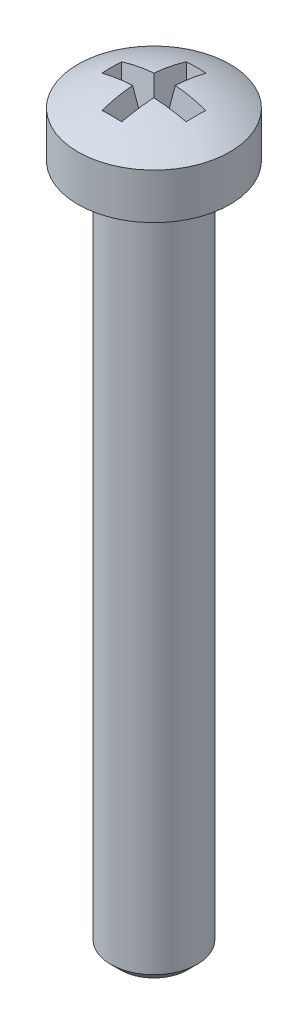
ISO-10303-21;
HEADER;
FILE_DESCRIPTION(('STEP AP214'),'2;1');
FILE_NAME('part.step','',(''),(''),'','','');
FILE_SCHEMA(('AUTOMOTIVE_DESIGN { 1 0 10303 214 1 1 1 1 }'));
ENDSEC;
DATA;
#1=APPLICATION_CONTEXT('core data for automotive mechanical design processes');
#2=APPLICATION_PROTOCOL_DEFINITION('international standard','automotive_design',2000,#1);
#3=PRODUCT_CONTEXT('',#1,'mechanical');
#4=PRODUCT('Part','Part','',(#3));
#5=PRODUCT_RELATED_PRODUCT_CATEGORY('part','',(#4));
#6=PRODUCT_DEFINITION_FORMATION('','',#4);
#7=PRODUCT_DEFINITION_CONTEXT('part definition',#1,'design');
#8=PRODUCT_DEFINITION('design','',#6,#7);
#9=PRODUCT_DEFINITION_SHAPE('','',#8);
#10=(LENGTH_UNIT() NAMED_UNIT(*) SI_UNIT(.MILLI.,.METRE.));
#11=(NAMED_UNIT(*) PLANE_ANGLE_UNIT() SI_UNIT($,.RADIAN.));
#12=(NAMED_UNIT(*) SI_UNIT($,.STERADIAN.) SOLID_ANGLE_UNIT());
#13=UNCERTAINTY_MEASURE_WITH_UNIT(LENGTH_MEASURE(1.E-05),#10,'distance_accuracy_value','');
#14=(GEOMETRIC_REPRESENTATION_CONTEXT(3) GLOBAL_UNCERTAINTY_ASSIGNED_CONTEXT((#13)) GLOBAL_UNIT_ASSIGNED_CONTEXT((#10,
#11,#12)) REPRESENTATION_CONTEXT('',''));
#15=CARTESIAN_POINT('',(0.,0.,0.));
#16=DIRECTION('',(0.,0.,1.));
#17=DIRECTION('',(1.,0.,0.));
#18=AXIS2_PLACEMENT_3D('',#15,#16,#17);
#19=CARTESIAN_POINT('',(5.7875,12.8,4.15199999999999));
#20=DIRECTION('',(0.,-0.149438132473599,0.988771077936042));
#21=DIRECTION('',(-1.,0.,0.));
#22=AXIS2_PLACEMENT_3D('',#19,#20,#21);
#23=PLANE('',#22);
#24=CARTESIAN_POINT('',(6.00000000000001,9.74139917848052,3.68973769788639));
#25=DIRECTION('',(0.,-0.149438132473599,0.988771077936042));
#26=DIRECTION('',(0.,0.988771077936042,0.149438132473599));
#27=AXIS2_PLACEMENT_3D('',#24,#25,#26);
#28=CIRCLE('',#27,2.97426048310416);
#29=CARTESIAN_POINT('',(6.19376146307785,12.6760147557736,4.13326146307783));
#30=VERTEX_POINT('',#29);
#31=CARTESIAN_POINT('',(5.80623853692216,12.6760147557736,4.13326146307783));
#32=VERTEX_POINT('',#31);
#33=EDGE_CURVE('E34',#30,#32,#28,.T.);
#34=ORIENTED_EDGE('',*,*,#33,.F.);
#35=DIRECTION('',(-0.14779696163853,-0.977912120929502,-0.14779696163853));
#36=VECTOR('',#35,1.);
#37=CARTESIAN_POINT('',(6.20785816235272,12.7692868564527,4.1473581623527));
#38=LINE('',#37,#36);
#39=CARTESIAN_POINT('',(6.01602421652422,11.5,3.9555242165242));
#40=VERTEX_POINT('',#39);
#41=EDGE_CURVE('E11',#30,#40,#38,.T.);
#42=ORIENTED_EDGE('',*,*,#41,.T.);
#43=DIRECTION('',(1.,0.,0.));
#44=VECTOR('',#43,1.);
#45=CARTESIAN_POINT('',(6.2125,11.5,3.9555242165242));
#46=LINE('',#45,#44);
#47=CARTESIAN_POINT('',(5.98397578347579,11.5,3.9555242165242));
#48=VERTEX_POINT('',#47);
#49=EDGE_CURVE('E20',#48,#40,#46,.T.);
#50=ORIENTED_EDGE('',*,*,#49,.F.);
#51=DIRECTION('',(0.14779696163853,-0.977912120929502,-0.14779696163853));
#52=VECTOR('',#51,1.);
#53=CARTESIAN_POINT('',(5.79446275647093,12.753930284679,4.14503724352908));
#54=LINE('',#53,#52);
#55=EDGE_CURVE('E26',#32,#48,#54,.T.);
#56=ORIENTED_EDGE('',*,*,#55,.F.);
#57=EDGE_LOOP('',(#34,#42,#50,#56));
#58=FACE_BOUND('',#57,.T.);
#59=ADVANCED_FACE('F16',(#58),#23,.F.);
#60=CARTESIAN_POINT('',(5.7875,12.8,3.5145));
#61=DIRECTION('',(-0.988771077936042,-0.149438132473599,0.));
#62=DIRECTION('',(0.,0.,-1.));
#63=AXIS2_PLACEMENT_3D('',#60,#61,#62);
#64=PLANE('',#63);
#65=CARTESIAN_POINT('',(6.2355258080224,9.83559624435382,3.302));
#66=DIRECTION('',(-0.988771077936042,-0.149438132473599,0.));
#67=DIRECTION('',(-0.149438132473599,0.988771077936042,0.));
#68=AXIS2_PLACEMENT_3D('',#65,#66,#67);
#69=CIRCLE('',#68,2.99052846519529);
#70=CARTESIAN_POINT('',(5.78973284200671,12.7852261965451,3.5122671579933));
#71=VERTEX_POINT('',#70);
#72=EDGE_CURVE('E255',#32,#71,#69,.T.);
#73=ORIENTED_EDGE('',*,*,#72,.F.);
#74=ORIENTED_EDGE('',*,*,#55,.T.);
#75=DIRECTION('',(0.,0.,1.));
#76=VECTOR('',#75,1.);
#77=CARTESIAN_POINT('',(5.98397578347579,11.5,4.15199999999999));
#78=LINE('',#77,#76);
#79=CARTESIAN_POINT('',(5.98397578347579,11.5,3.31802421652422));
#80=VERTEX_POINT('',#79);
#81=EDGE_CURVE('E120',#80,#48,#78,.T.);
#82=ORIENTED_EDGE('',*,*,#81,.F.);
#83=DIRECTION('',(0.14779696163853,-0.977912120929502,-0.14779696163853));
#84=VECTOR('',#83,1.);
#85=CARTESIAN_POINT('',(5.78053724352907,12.846069715321,3.52146275647092));
#86=LINE('',#85,#84);
#87=EDGE_CURVE('E229',#71,#80,#86,.T.);
#88=ORIENTED_EDGE('',*,*,#87,.F.);
#89=EDGE_LOOP('',(#73,#74,#82,#88));
#90=FACE_BOUND('',#89,.T.);
#91=ADVANCED_FACE('F160',(#90),#64,.F.);
#92=CARTESIAN_POINT('',(5.15,12.8,3.5145));
#93=DIRECTION('',(0.,-0.149438132473599,0.988771077936042));
#94=DIRECTION('',(-1.,0.,0.));
#95=AXIS2_PLACEMENT_3D('',#92,#93,#94);
#96=PLANE('',#95);
#97=CARTESIAN_POINT('',(6.00000000000001,9.83559624435382,3.06647419197759));
#98=DIRECTION('',(0.,-0.149438132473599,0.988771077936042));
#99=DIRECTION('',(0.,0.988771077936042,0.149438132473599));
#100=AXIS2_PLACEMENT_3D('',#97,#98,#99);
#101=CIRCLE('',#100,2.99052846519529);
#102=CARTESIAN_POINT('',(5.16873853692217,12.6760147557736,3.49576146307784));
#103=VERTEX_POINT('',#102);
#104=EDGE_CURVE('E257',#71,#103,#101,.T.);
#105=ORIENTED_EDGE('',*,*,#104,.F.);
#106=ORIENTED_EDGE('',*,*,#87,.T.);
#107=DIRECTION('',(1.,0.,0.));
#108=VECTOR('',#107,1.);
#109=CARTESIAN_POINT('',(5.7875,11.5,3.31802421652422));
#110=LINE('',#109,#108);
#111=CARTESIAN_POINT('',(5.34647578347579,11.5,3.31802421652422));
#112=VERTEX_POINT('',#111);
#113=EDGE_CURVE('E117',#112,#80,#110,.T.);
#114=ORIENTED_EDGE('',*,*,#113,.F.);
#115=DIRECTION('',(0.14779696163853,-0.977912120929502,-0.14779696163853));
#116=VECTOR('',#115,1.);
#117=CARTESIAN_POINT('',(5.15464183764729,12.7692868564527,3.50985816235272));
#118=LINE('',#117,#116);
#119=EDGE_CURVE('E226',#103,#112,#118,.T.);
#120=ORIENTED_EDGE('',*,*,#119,.F.);
#121=EDGE_LOOP('',(#105,#106,#114,#120));
#122=FACE_BOUND('',#121,.T.);
#123=ADVANCED_FACE('F164',(#122),#96,.F.);
#124=CARTESIAN_POINT('',(5.15,12.8,3.08949999999999));
#125=DIRECTION('',(-0.988771077936042,-0.149438132473599,0.));
#126=DIRECTION('',(0.,0.,-1.));
#127=AXIS2_PLACEMENT_3D('',#124,#125,#126);
#128=PLANE('',#127);
#129=CARTESIAN_POINT('',(5.61226230211363,9.74139917848052,3.302));
#130=DIRECTION('',(-0.988771077936042,-0.149438132473599,0.));
#131=DIRECTION('',(-0.149438132473599,0.988771077936042,0.));
#132=AXIS2_PLACEMENT_3D('',#129,#130,#131);
#133=CIRCLE('',#132,2.97426048310416);
#134=CARTESIAN_POINT('',(5.16873853692217,12.6760147557736,3.10823853692216));
#135=VERTEX_POINT('',#134);
#136=EDGE_CURVE('E139',#103,#135,#133,.T.);
#137=ORIENTED_EDGE('',*,*,#136,.F.);
#138=ORIENTED_EDGE('',*,*,#119,.T.);
#139=DIRECTION('',(0.,0.,1.));
#140=VECTOR('',#139,1.);
#141=CARTESIAN_POINT('',(5.34647578347579,11.5,3.5145));
#142=LINE('',#141,#140);
#143=CARTESIAN_POINT('',(5.34647578347579,11.5,3.28597578347578));
#144=VERTEX_POINT('',#143);
#145=EDGE_CURVE('E119',#144,#112,#142,.T.);
#146=ORIENTED_EDGE('',*,*,#145,.F.);
#147=DIRECTION('',(0.14779696163853,-0.977912120929502,0.14779696163853));
#148=VECTOR('',#147,1.);
#149=CARTESIAN_POINT('',(5.15696275647093,12.753930284679,3.09646275647094));
#150=LINE('',#149,#148);
#151=EDGE_CURVE('E230',#135,#144,#150,.T.);
#152=ORIENTED_EDGE('',*,*,#151,.F.);
#153=EDGE_LOOP('',(#137,#138,#146,#152));
#154=FACE_BOUND('',#153,.T.);
#155=ADVANCED_FACE('F170',(#154),#128,.F.);
#156=CARTESIAN_POINT('',(5.7875,12.8,3.08949999999999));
#157=DIRECTION('',(0.,-0.149438132473599,-0.988771077936042));
#158=DIRECTION('',(1.,0.,0.));
#159=AXIS2_PLACEMENT_3D('',#156,#157,#158);
#160=PLANE('',#159);
#161=CARTESIAN_POINT('',(6.00000000000001,9.83559624435382,3.53752580802241));
#162=DIRECTION('',(0.,-0.149438132473599,-0.988771077936042));
#163=DIRECTION('',(0.,-0.988771077936042,0.149438132473599));
#164=AXIS2_PLACEMENT_3D('',#161,#162,#163);
#165=CIRCLE('',#164,2.99052846519529);
#166=CARTESIAN_POINT('',(5.78973284200671,12.7852261965451,3.09173284200673));
#167=VERTEX_POINT('',#166);
#168=EDGE_CURVE('E109',#135,#167,#165,.T.);
#169=ORIENTED_EDGE('',*,*,#168,.F.);
#170=ORIENTED_EDGE('',*,*,#151,.T.);
#171=DIRECTION('',(-1.,0.,0.));
#172=VECTOR('',#171,1.);
#173=CARTESIAN_POINT('',(5.15,11.5,3.28597578347578));
#174=LINE('',#173,#172);
#175=CARTESIAN_POINT('',(5.98397578347579,11.5,3.28597578347578));
#176=VERTEX_POINT('',#175);
#177=EDGE_CURVE('E262',#176,#144,#174,.T.);
#178=ORIENTED_EDGE('',*,*,#177,.F.);
#179=DIRECTION('',(0.14779696163853,-0.977912120929502,0.14779696163853));
#180=VECTOR('',#179,1.);
#181=CARTESIAN_POINT('',(5.78053724352907,12.846069715321,3.08253724352908));
#182=LINE('',#181,#180);
#183=EDGE_CURVE('E231',#167,#176,#182,.T.);
#184=ORIENTED_EDGE('',*,*,#183,.F.);
#185=EDGE_LOOP('',(#169,#170,#178,#184));
#186=FACE_BOUND('',#185,.T.);
#187=ADVANCED_FACE('F182',(#186),#160,.F.);
#188=CARTESIAN_POINT('',(5.7875,12.8,2.45200000000001));
#189=DIRECTION('',(-0.988771077936042,-0.149438132473599,0.));
#190=DIRECTION('',(0.,0.,-1.));
#191=AXIS2_PLACEMENT_3D('',#188,#189,#190);
#192=PLANE('',#191);
#193=CARTESIAN_POINT('',(6.2355258080224,9.83559624435382,3.302));
#194=DIRECTION('',(-0.988771077936042,-0.149438132473599,0.));
#195=DIRECTION('',(-0.149438132473599,0.988771077936042,0.));
#196=AXIS2_PLACEMENT_3D('',#193,#194,#195);
#197=CIRCLE('',#196,2.99052846519529);
#198=CARTESIAN_POINT('',(5.80623853692216,12.6760147557736,2.47073853692217));
#199=VERTEX_POINT('',#198);
#200=EDGE_CURVE('E105',#167,#199,#197,.T.);
#201=ORIENTED_EDGE('',*,*,#200,.F.);
#202=ORIENTED_EDGE('',*,*,#183,.T.);
#203=DIRECTION('',(0.,0.,1.));
#204=VECTOR('',#203,1.);
#205=CARTESIAN_POINT('',(5.98397578347579,11.5,3.08949999999999));
#206=LINE('',#205,#204);
#207=CARTESIAN_POINT('',(5.98397578347579,11.5,2.6484757834758));
#208=VERTEX_POINT('',#207);
#209=EDGE_CURVE('E115',#208,#176,#206,.T.);
#210=ORIENTED_EDGE('',*,*,#209,.F.);
#211=DIRECTION('',(0.14779696163853,-0.977912120929502,0.14779696163853));
#212=VECTOR('',#211,1.);
#213=CARTESIAN_POINT('',(5.79214183764729,12.7692868564527,2.45664183764729));
#214=LINE('',#213,#212);
#215=EDGE_CURVE('E234',#199,#208,#214,.T.);
#216=ORIENTED_EDGE('',*,*,#215,.F.);
#217=EDGE_LOOP('',(#201,#202,#210,#216));
#218=FACE_BOUND('',#217,.T.);
#219=ADVANCED_FACE('F178',(#218),#192,.F.);
#220=CARTESIAN_POINT('',(6.2125,12.8,2.45200000000001));
#221=DIRECTION('',(0.,-0.149438132473599,-0.988771077936042));
#222=DIRECTION('',(1.,0.,0.));
#223=AXIS2_PLACEMENT_3D('',#220,#221,#222);
#224=PLANE('',#223);
#225=CARTESIAN_POINT('',(6.00000000000001,9.74139917848052,2.91426230211361));
#226=DIRECTION('',(0.,-0.149438132473599,-0.988771077936042));
#227=DIRECTION('',(0.,-0.988771077936042,0.149438132473599));
#228=AXIS2_PLACEMENT_3D('',#225,#226,#227);
#229=CIRCLE('',#228,2.97426048310416);
#230=CARTESIAN_POINT('',(6.19376146307785,12.6760147557736,2.47073853692217));
#231=VERTEX_POINT('',#230);
#232=EDGE_CURVE('E201',#199,#231,#229,.T.);
#233=ORIENTED_EDGE('',*,*,#232,.F.);
#234=ORIENTED_EDGE('',*,*,#215,.T.);
#235=DIRECTION('',(-1.,0.,0.));
#236=VECTOR('',#235,1.);
#237=CARTESIAN_POINT('',(5.7875,11.5,2.6484757834758));
#238=LINE('',#237,#236);
#239=CARTESIAN_POINT('',(6.01602421652422,11.5,2.6484757834758));
#240=VERTEX_POINT('',#239);
#241=EDGE_CURVE('E214',#240,#208,#238,.T.);
#242=ORIENTED_EDGE('',*,*,#241,.F.);
#243=DIRECTION('',(-0.14779696163853,-0.977912120929502,0.14779696163853));
#244=VECTOR('',#243,1.);
#245=CARTESIAN_POINT('',(6.20553724352907,12.753930284679,2.45896275647092));
#246=LINE('',#245,#244);
#247=EDGE_CURVE('E212',#231,#240,#246,.T.);
#248=ORIENTED_EDGE('',*,*,#247,.F.);
#249=EDGE_LOOP('',(#233,#234,#242,#248));
#250=FACE_BOUND('',#249,.T.);
#251=ADVANCED_FACE('F181',(#250),#224,.F.);
#252=CARTESIAN_POINT('',(6.2125,12.8,4.15199999999999));
#253=DIRECTION('',(0.988771077936042,-0.149438132473599,0.));
#254=DIRECTION('',(0.,0.,1.));
#255=AXIS2_PLACEMENT_3D('',#252,#253,#254);
#256=PLANE('',#255);
#257=CARTESIAN_POINT('',(5.76447419197759,9.83559624435382,3.302));
#258=DIRECTION('',(0.988771077936042,-0.149438132473599,0.));
#259=DIRECTION('',(-0.149438132473599,-0.988771077936042,0.));
#260=AXIS2_PLACEMENT_3D('',#257,#258,#259);
#261=CIRCLE('',#260,2.99052846519529);
#262=CARTESIAN_POINT('',(6.21026715799329,12.7852261965451,3.5122671579933));
#263=VERTEX_POINT('',#262);
#264=EDGE_CURVE('E240',#263,#30,#261,.T.);
#265=ORIENTED_EDGE('',*,*,#264,.F.);
#266=DIRECTION('',(-0.14779696163853,-0.977912120929502,-0.14779696163853));
#267=VECTOR('',#266,1.);
#268=CARTESIAN_POINT('',(6.21946275647094,12.846069715321,3.52146275647092));
#269=LINE('',#268,#267);
#270=CARTESIAN_POINT('',(6.01602421652422,11.5,3.31802421652422));
#271=VERTEX_POINT('',#270);
#272=EDGE_CURVE('E243',#263,#271,#269,.T.);
#273=ORIENTED_EDGE('',*,*,#272,.T.);
#274=DIRECTION('',(0.,0.,-1.));
#275=VECTOR('',#274,1.);
#276=CARTESIAN_POINT('',(6.01602421652422,11.5,3.5145));
#277=LINE('',#276,#275);
#278=EDGE_CURVE('E248',#40,#271,#277,.T.);
#279=ORIENTED_EDGE('',*,*,#278,.F.);
#280=ORIENTED_EDGE('',*,*,#41,.F.);
#281=EDGE_LOOP('',(#265,#273,#279,#280));
#282=FACE_BOUND('',#281,.T.);
#283=ADVANCED_FACE('F187',(#282),#256,.F.);
#284=CARTESIAN_POINT('',(6.2125,12.8,3.5145));
#285=DIRECTION('',(0.,-0.149438132473599,0.988771077936042));
#286=DIRECTION('',(-1.,0.,0.));
#287=AXIS2_PLACEMENT_3D('',#284,#285,#286);
#288=PLANE('',#287);
#289=CARTESIAN_POINT('',(6.00000000000001,9.83559624435382,3.06647419197759));
#290=DIRECTION('',(0.,-0.149438132473599,0.988771077936042));
#291=DIRECTION('',(0.,0.988771077936042,0.149438132473599));
#292=AXIS2_PLACEMENT_3D('',#289,#290,#291);
#293=CIRCLE('',#292,2.99052846519529);
#294=CARTESIAN_POINT('',(6.83126146307784,12.6760147557736,3.49576146307784));
#295=VERTEX_POINT('',#294);
#296=EDGE_CURVE('E237',#295,#263,#293,.T.);
#297=ORIENTED_EDGE('',*,*,#296,.F.);
#298=DIRECTION('',(-0.14779696163853,-0.977912120929502,-0.14779696163853));
#299=VECTOR('',#298,1.);
#300=CARTESIAN_POINT('',(6.84303724352907,12.753930284679,3.50753724352906));
#301=LINE('',#300,#299);
#302=CARTESIAN_POINT('',(6.65352421652422,11.5,3.31802421652422));
#303=VERTEX_POINT('',#302);
#304=EDGE_CURVE('E136',#295,#303,#301,.T.);
#305=ORIENTED_EDGE('',*,*,#304,.T.);
#306=DIRECTION('',(1.,0.,0.));
#307=VECTOR('',#306,1.);
#308=CARTESIAN_POINT('',(6.85,11.5,3.31802421652422));
#309=LINE('',#308,#307);
#310=EDGE_CURVE('E224',#271,#303,#309,.T.);
#311=ORIENTED_EDGE('',*,*,#310,.F.);
#312=ORIENTED_EDGE('',*,*,#272,.F.);
#313=EDGE_LOOP('',(#297,#305,#311,#312));
#314=FACE_BOUND('',#313,.T.);
#315=ADVANCED_FACE('F184',(#314),#288,.F.);
#316=CARTESIAN_POINT('',(6.85,12.8,3.5145));
#317=DIRECTION('',(0.988771077936042,-0.149438132473599,0.));
#318=DIRECTION('',(0.,0.,1.));
#319=AXIS2_PLACEMENT_3D('',#316,#317,#318);
#320=PLANE('',#319);
#321=CARTESIAN_POINT('',(6.38773769788636,9.74139917848052,3.302));
#322=DIRECTION('',(0.988771077936042,-0.149438132473599,0.));
#323=DIRECTION('',(-0.149438132473599,-0.988771077936042,0.));
#324=AXIS2_PLACEMENT_3D('',#321,#322,#323);
#325=CIRCLE('',#324,2.97426048310416);
#326=CARTESIAN_POINT('',(6.83126146307784,12.6760147557736,3.10823853692216));
#327=VERTEX_POINT('',#326);
#328=EDGE_CURVE('E128',#327,#295,#325,.T.);
#329=ORIENTED_EDGE('',*,*,#328,.F.);
#330=DIRECTION('',(-0.14779696163853,-0.977912120929502,0.14779696163853));
#331=VECTOR('',#330,1.);
#332=CARTESIAN_POINT('',(6.84535816235271,12.7692868564527,3.09414183764728));
#333=LINE('',#332,#331);
#334=CARTESIAN_POINT('',(6.65352421652422,11.5,3.28597578347578));
#335=VERTEX_POINT('',#334);
#336=EDGE_CURVE('E133',#327,#335,#333,.T.);
#337=ORIENTED_EDGE('',*,*,#336,.T.);
#338=DIRECTION('',(0.,0.,-1.));
#339=VECTOR('',#338,1.);
#340=CARTESIAN_POINT('',(6.65352421652422,11.5,3.08949999999999));
#341=LINE('',#340,#339);
#342=EDGE_CURVE('E131',#303,#335,#341,.T.);
#343=ORIENTED_EDGE('',*,*,#342,.F.);
#344=ORIENTED_EDGE('',*,*,#304,.F.);
#345=EDGE_LOOP('',(#329,#337,#343,#344));
#346=FACE_BOUND('',#345,.T.);
#347=ADVANCED_FACE('F186',(#346),#320,.F.);
#348=CARTESIAN_POINT('',(6.85,12.8,3.08949999999999));
#349=DIRECTION('',(0.,-0.149438132473599,-0.988771077936042));
#350=DIRECTION('',(1.,0.,0.));
#351=AXIS2_PLACEMENT_3D('',#348,#349,#350);
#352=PLANE('',#351);
#353=CARTESIAN_POINT('',(6.00000000000001,9.83559624435382,3.53752580802241));
#354=DIRECTION('',(0.,-0.149438132473599,-0.988771077936042));
#355=DIRECTION('',(0.,-0.988771077936042,0.149438132473599));
#356=AXIS2_PLACEMENT_3D('',#353,#354,#355);
#357=CIRCLE('',#356,2.99052846519529);
#358=CARTESIAN_POINT('',(6.21026715799329,12.7852261965451,3.09173284200673));
#359=VERTEX_POINT('',#358);
#360=EDGE_CURVE('E124',#359,#327,#357,.T.);
#361=ORIENTED_EDGE('',*,*,#360,.F.);
#362=DIRECTION('',(-0.14779696163853,-0.977912120929502,0.14779696163853));
#363=VECTOR('',#362,1.);
#364=CARTESIAN_POINT('',(6.21946275647094,12.846069715321,3.08253724352908));
#365=LINE('',#364,#363);
#366=CARTESIAN_POINT('',(6.01602421652422,11.5,3.28597578347578));
#367=VERTEX_POINT('',#366);
#368=EDGE_CURVE('E137',#359,#367,#365,.T.);
#369=ORIENTED_EDGE('',*,*,#368,.T.);
#370=DIRECTION('',(-1.,0.,0.));
#371=VECTOR('',#370,1.);
#372=CARTESIAN_POINT('',(6.2125,11.5,3.28597578347578));
#373=LINE('',#372,#371);
#374=EDGE_CURVE('E129',#335,#367,#373,.T.);
#375=ORIENTED_EDGE('',*,*,#374,.F.);
#376=ORIENTED_EDGE('',*,*,#336,.F.);
#377=EDGE_LOOP('',(#361,#369,#375,#376));
#378=FACE_BOUND('',#377,.T.);
#379=ADVANCED_FACE('F292',(#378),#352,.F.);
#380=CARTESIAN_POINT('',(6.2125,12.8,3.08949999999999));
#381=DIRECTION('',(0.988771077936042,-0.149438132473599,0.));
#382=DIRECTION('',(0.,0.,1.));
#383=AXIS2_PLACEMENT_3D('',#380,#381,#382);
#384=PLANE('',#383);
#385=CARTESIAN_POINT('',(5.76447419197759,9.83559624435382,3.302));
#386=DIRECTION('',(0.988771077936042,-0.149438132473599,0.));
#387=DIRECTION('',(-0.149438132473599,-0.988771077936042,0.));
#388=AXIS2_PLACEMENT_3D('',#385,#386,#387);
#389=CIRCLE('',#388,2.99052846519529);
#390=EDGE_CURVE('E127',#231,#359,#389,.T.);
#391=ORIENTED_EDGE('',*,*,#390,.F.);
#392=ORIENTED_EDGE('',*,*,#247,.T.);
#393=DIRECTION('',(0.,0.,-1.));
#394=VECTOR('',#393,1.);
#395=CARTESIAN_POINT('',(6.01602421652422,11.5,2.45200000000001));
#396=LINE('',#395,#394);
#397=EDGE_CURVE('E132',#367,#240,#396,.T.);
#398=ORIENTED_EDGE('',*,*,#397,.F.);
#399=ORIENTED_EDGE('',*,*,#368,.F.);
#400=EDGE_LOOP('',(#391,#392,#398,#399));
#401=FACE_BOUND('',#400,.T.);
#402=ADVANCED_FACE('F197',(#401),#384,.F.);
#403=CARTESIAN_POINT('',(6.00000000000001,11.5,3.302));
#404=DIRECTION('',(0.,-1.,0.));
#405=DIRECTION('',(1.,0.,0.));
#406=AXIS2_PLACEMENT_3D('',#403,#404,#405);
#407=PLANE('',#406);
#408=ORIENTED_EDGE('',*,*,#241,.T.);
#409=ORIENTED_EDGE('',*,*,#209,.T.);
#410=ORIENTED_EDGE('',*,*,#177,.T.);
#411=ORIENTED_EDGE('',*,*,#145,.T.);
#412=ORIENTED_EDGE('',*,*,#113,.T.);
#413=ORIENTED_EDGE('',*,*,#81,.T.);
#414=ORIENTED_EDGE('',*,*,#49,.T.);
#415=ORIENTED_EDGE('',*,*,#278,.T.);
#416=ORIENTED_EDGE('',*,*,#310,.T.);
#417=ORIENTED_EDGE('',*,*,#342,.T.);
#418=ORIENTED_EDGE('',*,*,#374,.T.);
#419=ORIENTED_EDGE('',*,*,#397,.T.);
#420=EDGE_LOOP('',(#408,#409,#410,#411,#412,#413,#414,#415,#416,#417,#418,#419));
#421=FACE_BOUND('',#420,.T.);
#422=ADVANCED_FACE('F176',(#421),#407,.F.);
#423=CARTESIAN_POINT('',(6.00000000000001,9.8,3.302));
#424=DIRECTION('',(-1.,0.,0.));
#425=DIRECTION('',(0.,-1.,0.));
#426=AXIS2_PLACEMENT_3D('',#423,#424,#425);
#427=SPHERICAL_SURFACE('',#426,3.);
#428=ORIENTED_EDGE('',*,*,#232,.T.);
#429=ORIENTED_EDGE('',*,*,#390,.T.);
#430=ORIENTED_EDGE('',*,*,#360,.T.);
#431=ORIENTED_EDGE('',*,*,#328,.T.);
#432=ORIENTED_EDGE('',*,*,#296,.T.);
#433=ORIENTED_EDGE('',*,*,#264,.T.);
#434=ORIENTED_EDGE('',*,*,#33,.T.);
#435=ORIENTED_EDGE('',*,*,#72,.T.);
#436=ORIENTED_EDGE('',*,*,#104,.T.);
#437=ORIENTED_EDGE('',*,*,#136,.T.);
#438=ORIENTED_EDGE('',*,*,#168,.T.);
#439=ORIENTED_EDGE('',*,*,#200,.T.);
#440=EDGE_LOOP('',(#428,#429,#430,#431,#432,#433,#434,#435,#436,#437,#438,#439));
#441=FACE_BOUND('',#440,.T.);
#442=CARTESIAN_POINT('',(6.00000000000001,12.3980762113533,3.302));
#443=DIRECTION('',(0.,-1.,0.));
#444=DIRECTION('',(0.,0.,1.));
#445=AXIS2_PLACEMENT_3D('',#442,#443,#444);
#446=CIRCLE('',#445,1.5);
#447=CARTESIAN_POINT('',(6.00000000000001,12.3980762113533,4.802));
#448=VERTEX_POINT('',#447);
#449=EDGE_CURVE('E102',#448,#448,#446,.T.);
#450=ORIENTED_EDGE('',*,*,#449,.F.);
#451=EDGE_LOOP('',(#450));
#452=FACE_BOUND('',#451,.T.);
#453=ADVANCED_FACE('F103',(#441,#452),#427,.T.);
#454=CARTESIAN_POINT('',(6.00000000000001,11.9490381056767,3.302));
#455=DIRECTION('',(0.,1.,0.));
#456=DIRECTION('',(0.,0.,1.));
#457=AXIS2_PLACEMENT_3D('',#454,#455,#456);
#458=CYLINDRICAL_SURFACE('',#457,1.5);
#459=CARTESIAN_POINT('',(6.00000000000001,11.5,3.302));
#460=DIRECTION('',(0.,-1.,0.));
#461=DIRECTION('',(0.,0.,1.));
#462=AXIS2_PLACEMENT_3D('',#459,#460,#461);
#463=CIRCLE('',#462,1.5);
#464=CARTESIAN_POINT('',(6.00000000000001,11.5,4.802));
#465=VERTEX_POINT('',#464);
#466=EDGE_CURVE('E106',#465,#465,#463,.T.);
#467=ORIENTED_EDGE('',*,*,#466,.F.);
#468=EDGE_LOOP('',(#467));
#469=FACE_BOUND('',#468,.T.);
#470=ORIENTED_EDGE('',*,*,#449,.T.);
#471=EDGE_LOOP('',(#470));
#472=FACE_BOUND('',#471,.T.);
#473=ADVANCED_FACE('F155',(#469,#472),#458,.T.);
#474=CARTESIAN_POINT('',(6.00000000000001,11.5,4.527));
#475=DIRECTION('',(0.,-1.,0.));
#476=DIRECTION('',(0.,0.,1.));
#477=AXIS2_PLACEMENT_3D('',#474,#475,#476);
#478=PLANE('',#477);
#479=CARTESIAN_POINT('',(6.00000000000001,11.5,3.302));
#480=DIRECTION('',(0.,-1.,0.));
#481=DIRECTION('',(0.,0.,1.));
#482=AXIS2_PLACEMENT_3D('',#479,#480,#481);
#483=CIRCLE('',#482,0.95);
#484=CARTESIAN_POINT('',(6.00000000000001,11.5,4.25200000000001));
#485=VERTEX_POINT('',#484);
#486=EDGE_CURVE('E55',#485,#485,#483,.T.);
#487=ORIENTED_EDGE('',*,*,#486,.F.);
#488=EDGE_LOOP('',(#487));
#489=FACE_BOUND('',#488,.T.);
#490=ORIENTED_EDGE('',*,*,#466,.T.);
#491=EDGE_LOOP('',(#490));
#492=FACE_BOUND('',#491,.T.);
#493=ADVANCED_FACE('F146',(#489,#492),#478,.T.);
#494=CARTESIAN_POINT('',(6.00000000000001,11.4,3.302));
#495=DIRECTION('',(0.,-1.,0.));
#496=DIRECTION('',(1.,0.,0.));
#497=AXIS2_PLACEMENT_3D('',#494,#495,#496);
#498=TOROIDAL_SURFACE('',#497,0.95,0.1);
#499=CARTESIAN_POINT('',(6.00000000000001,11.4,3.302));
#500=DIRECTION('',(0.,-1.,0.));
#501=DIRECTION('',(0.,0.,1.));
#502=AXIS2_PLACEMENT_3D('',#499,#500,#501);
#503=CIRCLE('',#502,0.85);
#504=CARTESIAN_POINT('',(6.00000000000001,11.4,4.15199999999999));
#505=VERTEX_POINT('',#504);
#506=EDGE_CURVE('E64',#505,#505,#503,.T.);
#507=ORIENTED_EDGE('',*,*,#506,.F.);
#508=EDGE_LOOP('',(#507));
#509=FACE_BOUND('',#508,.T.);
#510=ORIENTED_EDGE('',*,*,#486,.T.);
#511=EDGE_LOOP('',(#510));
#512=FACE_BOUND('',#511,.T.);
#513=ADVANCED_FACE('F143',(#509,#512),#498,.F.);
#514=CARTESIAN_POINT('',(6.00000000000001,4.79471875000001,3.302));
#515=DIRECTION('',(0.,1.,0.));
#516=DIRECTION('',(0.,0.,1.));
#517=AXIS2_PLACEMENT_3D('',#514,#515,#516);
#518=CYLINDRICAL_SURFACE('',#517,0.85);
#519=CARTESIAN_POINT('',(6.00000000000001,-1.8105625,3.302));
#520=DIRECTION('',(0.,-1.,0.));
#521=DIRECTION('',(0.,0.,1.));
#522=AXIS2_PLACEMENT_3D('',#519,#520,#521);
#523=CIRCLE('',#522,0.85);
#524=CARTESIAN_POINT('',(6.00000000000001,-1.8105625,4.15199999999999));
#525=VERTEX_POINT('',#524);
#526=EDGE_CURVE('E123',#525,#525,#523,.T.);
#527=ORIENTED_EDGE('',*,*,#526,.F.);
#528=EDGE_LOOP('',(#527));
#529=FACE_BOUND('',#528,.T.);
#530=ORIENTED_EDGE('',*,*,#506,.T.);
#531=EDGE_LOOP('',(#530));
#532=FACE_BOUND('',#531,.T.);
#533=ADVANCED_FACE('F145',(#529,#532),#518,.T.);
#534=CARTESIAN_POINT('',(6.00000000000001,-1.90528125,3.302));
#535=DIRECTION('',(0.,1.,0.));
#536=DIRECTION('',(0.,0.,1.));
#537=AXIS2_PLACEMENT_3D('',#534,#535,#536);
#538=CONICAL_SURFACE('',#537,0.75528125,0.785398163397448);
#539=CARTESIAN_POINT('',(6.00000000000001,-2.,3.302));
#540=DIRECTION('',(0.,-1.,0.));
#541=DIRECTION('',(0.,0.,1.));
#542=AXIS2_PLACEMENT_3D('',#539,#540,#541);
#543=CIRCLE('',#542,0.6605625);
#544=CARTESIAN_POINT('',(6.00000000000001,-2.,3.96256249999999));
#545=VERTEX_POINT('',#544);
#546=EDGE_CURVE('E141',#545,#545,#543,.T.);
#547=ORIENTED_EDGE('',*,*,#546,.F.);
#548=EDGE_LOOP('',(#547));
#549=FACE_BOUND('',#548,.T.);
#550=ORIENTED_EDGE('',*,*,#526,.T.);
#551=EDGE_LOOP('',(#550));
#552=FACE_BOUND('',#551,.T.);
#553=ADVANCED_FACE('F18',(#549,#552),#538,.T.);
#554=CARTESIAN_POINT('',(6.00000000000001,-2.,3.63228125000001));
#555=DIRECTION('',(0.,-1.,0.));
#556=DIRECTION('',(0.,0.,1.));
#557=AXIS2_PLACEMENT_3D('',#554,#555,#556);
#558=PLANE('',#557);
#559=ORIENTED_EDGE('',*,*,#546,.T.);
#560=EDGE_LOOP('',(#559));
#561=FACE_BOUND('',#560,.T.);
#562=ADVANCED_FACE('F326',(#561),#558,.T.);
#563=CLOSED_SHELL('',(#59,#91,#123,#155,#187,#219,#251,#283,#315,#347,#379,#402,#422,#453,#473,
#493,#513,#533,#553,#562));
#564=MANIFOLD_SOLID_BREP('B1',#563);
#565=ADVANCED_BREP_SHAPE_REPRESENTATION('',(#18,#564),#14);
#566=SHAPE_DEFINITION_REPRESENTATION(#9,#565);
ENDSEC;
END-ISO-10303-21;
